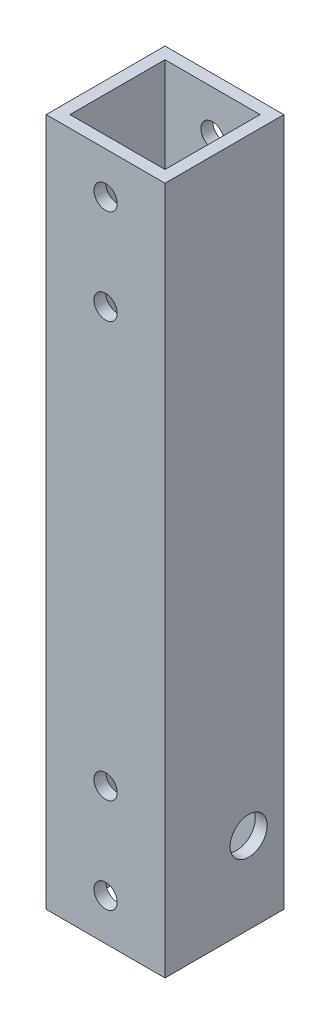
ISO-10303-21;
HEADER;
FILE_DESCRIPTION(('STEP AP214'),'2;1');
FILE_NAME('part.step','',(''),(''),'','','');
FILE_SCHEMA(('AUTOMOTIVE_DESIGN { 1 0 10303 214 1 1 1 1 }'));
ENDSEC;
DATA;
#1=APPLICATION_CONTEXT('core data for automotive mechanical design processes');
#2=APPLICATION_PROTOCOL_DEFINITION('international standard','automotive_design',2000,#1);
#3=PRODUCT_CONTEXT('',#1,'mechanical');
#4=PRODUCT('Part','Part','',(#3));
#5=PRODUCT_RELATED_PRODUCT_CATEGORY('part','',(#4));
#6=PRODUCT_DEFINITION_FORMATION('','',#4);
#7=PRODUCT_DEFINITION_CONTEXT('part definition',#1,'design');
#8=PRODUCT_DEFINITION('design','',#6,#7);
#9=PRODUCT_DEFINITION_SHAPE('','',#8);
#10=(LENGTH_UNIT() NAMED_UNIT(*) SI_UNIT(.MILLI.,.METRE.));
#11=(NAMED_UNIT(*) PLANE_ANGLE_UNIT() SI_UNIT($,.RADIAN.));
#12=(NAMED_UNIT(*) SI_UNIT($,.STERADIAN.) SOLID_ANGLE_UNIT());
#13=UNCERTAINTY_MEASURE_WITH_UNIT(LENGTH_MEASURE(1.E-05),#10,'distance_accuracy_value','');
#14=(GEOMETRIC_REPRESENTATION_CONTEXT(3) GLOBAL_UNCERTAINTY_ASSIGNED_CONTEXT((#13)) GLOBAL_UNIT_ASSIGNED_CONTEXT((#10,
#11,#12)) REPRESENTATION_CONTEXT('',''));
#15=CARTESIAN_POINT('',(0.,0.,0.));
#16=DIRECTION('',(0.,0.,1.));
#17=DIRECTION('',(1.,0.,0.));
#18=AXIS2_PLACEMENT_3D('',#15,#16,#17);
#19=CARTESIAN_POINT('',(25.4,0.,25.4));
#20=DIRECTION('',(0.,1.,0.));
#21=DIRECTION('',(-1.,0.,0.));
#22=AXIS2_PLACEMENT_3D('',#19,#20,#21);
#23=PLANE('',#22);
#24=DIRECTION('',(1.,0.,0.));
#25=VECTOR('',#24,1.);
#26=CARTESIAN_POINT('',(0.,0.,22.86));
#27=LINE('',#26,#25);
#28=CARTESIAN_POINT('',(2.54000000000001,0.,22.86));
#29=VERTEX_POINT('',#28);
#30=CARTESIAN_POINT('',(22.86,0.,22.86));
#31=VERTEX_POINT('',#30);
#32=EDGE_CURVE('E112',#29,#31,#27,.T.);
#33=ORIENTED_EDGE('',*,*,#32,.T.);
#34=DIRECTION('',(0.,0.,-1.));
#35=VECTOR('',#34,1.);
#36=CARTESIAN_POINT('',(22.86,0.,0.));
#37=LINE('',#36,#35);
#38=CARTESIAN_POINT('',(22.86,0.,2.54));
#39=VERTEX_POINT('',#38);
#40=EDGE_CURVE('E106',#31,#39,#37,.T.);
#41=ORIENTED_EDGE('',*,*,#40,.T.);
#42=DIRECTION('',(-1.,0.,0.));
#43=VECTOR('',#42,1.);
#44=CARTESIAN_POINT('',(0.,0.,2.54));
#45=LINE('',#44,#43);
#46=CARTESIAN_POINT('',(2.54,0.,2.54));
#47=VERTEX_POINT('',#46);
#48=EDGE_CURVE('E115',#39,#47,#45,.T.);
#49=ORIENTED_EDGE('',*,*,#48,.T.);
#50=DIRECTION('',(0.,0.,1.));
#51=VECTOR('',#50,1.);
#52=CARTESIAN_POINT('',(2.54,0.,0.));
#53=LINE('',#52,#51);
#54=EDGE_CURVE('E54',#47,#29,#53,.T.);
#55=ORIENTED_EDGE('',*,*,#54,.T.);
#56=EDGE_LOOP('',(#33,#41,#49,#55));
#57=FACE_BOUND('',#56,.T.);
#58=DIRECTION('',(1.,0.,0.));
#59=VECTOR('',#58,1.);
#60=CARTESIAN_POINT('',(25.4,0.,0.));
#61=LINE('',#60,#59);
#62=CARTESIAN_POINT('',(0.,0.,0.));
#63=VERTEX_POINT('',#62);
#64=CARTESIAN_POINT('',(25.4,0.,0.));
#65=VERTEX_POINT('',#64);
#66=EDGE_CURVE('E139',#63,#65,#61,.T.);
#67=ORIENTED_EDGE('',*,*,#66,.T.);
#68=DIRECTION('',(0.,0.,-1.));
#69=VECTOR('',#68,1.);
#70=CARTESIAN_POINT('',(25.4,0.,25.4));
#71=LINE('',#70,#69);
#72=CARTESIAN_POINT('',(25.4,0.,25.4));
#73=VERTEX_POINT('',#72);
#74=EDGE_CURVE('E12',#73,#65,#71,.T.);
#75=ORIENTED_EDGE('',*,*,#74,.F.);
#76=DIRECTION('',(1.,0.,0.));
#77=VECTOR('',#76,1.);
#78=CARTESIAN_POINT('',(25.4,0.,25.4));
#79=LINE('',#78,#77);
#80=CARTESIAN_POINT('',(0.,0.,25.4));
#81=VERTEX_POINT('',#80);
#82=EDGE_CURVE('E143',#81,#73,#79,.T.);
#83=ORIENTED_EDGE('',*,*,#82,.F.);
#84=DIRECTION('',(0.,0.,-1.));
#85=VECTOR('',#84,1.);
#86=CARTESIAN_POINT('',(0.,0.,25.4));
#87=LINE('',#86,#85);
#88=EDGE_CURVE('E153',#81,#63,#87,.T.);
#89=ORIENTED_EDGE('',*,*,#88,.T.);
#90=EDGE_LOOP('',(#67,#75,#83,#89));
#91=FACE_BOUND('',#90,.T.);
#92=ADVANCED_FACE('F38',(#57,#91),#23,.F.);
#93=CARTESIAN_POINT('',(25.4,147.155789,25.4));
#94=DIRECTION('',(-1.,0.,0.));
#95=DIRECTION('',(0.,-1.,0.));
#96=AXIS2_PLACEMENT_3D('',#93,#94,#95);
#97=PLANE('',#96);
#98=CARTESIAN_POINT('',(25.4,17.3804072,7.5184));
#99=DIRECTION('',(1.,0.,0.));
#100=DIRECTION('',(0.,1.,0.));
#101=AXIS2_PLACEMENT_3D('',#98,#99,#100);
#102=CIRCLE('',#101,3.9624);
#103=CARTESIAN_POINT('',(25.4,21.3428072,7.5184));
#104=VERTEX_POINT('',#103);
#105=EDGE_CURVE('E219',#104,#104,#102,.T.);
#106=ORIENTED_EDGE('',*,*,#105,.F.);
#107=EDGE_LOOP('',(#106));
#108=FACE_BOUND('',#107,.T.);
#109=DIRECTION('',(0.,1.,0.));
#110=VECTOR('',#109,1.);
#111=CARTESIAN_POINT('',(25.4,147.155789,0.));
#112=LINE('',#111,#110);
#113=CARTESIAN_POINT('',(25.4,147.155789,0.));
#114=VERTEX_POINT('',#113);
#115=EDGE_CURVE('E156',#65,#114,#112,.T.);
#116=ORIENTED_EDGE('',*,*,#115,.T.);
#117=DIRECTION('',(0.,0.,-1.));
#118=VECTOR('',#117,1.);
#119=CARTESIAN_POINT('',(25.4,147.155789,25.4));
#120=LINE('',#119,#118);
#121=CARTESIAN_POINT('',(25.4,147.155789,25.4));
#122=VERTEX_POINT('',#121);
#123=EDGE_CURVE('E46',#122,#114,#120,.T.);
#124=ORIENTED_EDGE('',*,*,#123,.F.);
#125=DIRECTION('',(0.,1.,0.));
#126=VECTOR('',#125,1.);
#127=CARTESIAN_POINT('',(25.4,147.155789,25.4));
#128=LINE('',#127,#126);
#129=EDGE_CURVE('E146',#73,#122,#128,.T.);
#130=ORIENTED_EDGE('',*,*,#129,.F.);
#131=ORIENTED_EDGE('',*,*,#74,.T.);
#132=EDGE_LOOP('',(#116,#124,#130,#131));
#133=FACE_BOUND('',#132,.T.);
#134=ADVANCED_FACE('F247',(#108,#133),#97,.F.);
#135=CARTESIAN_POINT('',(0.,147.155789,25.4));
#136=DIRECTION('',(0.,-1.,0.));
#137=DIRECTION('',(0.,0.,-1.));
#138=AXIS2_PLACEMENT_3D('',#135,#136,#137);
#139=PLANE('',#138);
#140=DIRECTION('',(-1.,0.,0.));
#141=VECTOR('',#140,1.);
#142=CARTESIAN_POINT('',(0.,147.155789,2.54));
#143=LINE('',#142,#141);
#144=CARTESIAN_POINT('',(22.86,147.155789,2.54));
#145=VERTEX_POINT('',#144);
#146=CARTESIAN_POINT('',(2.54,147.155789,2.54));
#147=VERTEX_POINT('',#146);
#148=EDGE_CURVE('E133',#145,#147,#143,.T.);
#149=ORIENTED_EDGE('',*,*,#148,.F.);
#150=DIRECTION('',(0.,0.,-1.));
#151=VECTOR('',#150,1.);
#152=CARTESIAN_POINT('',(22.86,147.155789,0.));
#153=LINE('',#152,#151);
#154=CARTESIAN_POINT('',(22.86,147.155789,22.86));
#155=VERTEX_POINT('',#154);
#156=EDGE_CURVE('E62',#155,#145,#153,.T.);
#157=ORIENTED_EDGE('',*,*,#156,.F.);
#158=DIRECTION('',(1.,0.,0.));
#159=VECTOR('',#158,1.);
#160=CARTESIAN_POINT('',(0.,147.155789,22.86));
#161=LINE('',#160,#159);
#162=CARTESIAN_POINT('',(2.54000000000001,147.155789,22.86));
#163=VERTEX_POINT('',#162);
#164=EDGE_CURVE('E121',#163,#155,#161,.T.);
#165=ORIENTED_EDGE('',*,*,#164,.F.);
#166=DIRECTION('',(0.,0.,1.));
#167=VECTOR('',#166,1.);
#168=CARTESIAN_POINT('',(2.54,147.155789,0.));
#169=LINE('',#168,#167);
#170=EDGE_CURVE('E124',#147,#163,#169,.T.);
#171=ORIENTED_EDGE('',*,*,#170,.F.);
#172=EDGE_LOOP('',(#149,#157,#165,#171));
#173=FACE_BOUND('',#172,.T.);
#174=DIRECTION('',(-1.,0.,0.));
#175=VECTOR('',#174,1.);
#176=CARTESIAN_POINT('',(0.,147.155789,0.));
#177=LINE('',#176,#175);
#178=CARTESIAN_POINT('',(0.,147.155789,0.));
#179=VERTEX_POINT('',#178);
#180=EDGE_CURVE('E158',#114,#179,#177,.T.);
#181=ORIENTED_EDGE('',*,*,#180,.T.);
#182=DIRECTION('',(0.,0.,-1.));
#183=VECTOR('',#182,1.);
#184=CARTESIAN_POINT('',(0.,147.155789,25.4));
#185=LINE('',#184,#183);
#186=CARTESIAN_POINT('',(0.,147.155789,25.4));
#187=VERTEX_POINT('',#186);
#188=EDGE_CURVE('E163',#187,#179,#185,.T.);
#189=ORIENTED_EDGE('',*,*,#188,.F.);
#190=DIRECTION('',(-1.,0.,0.));
#191=VECTOR('',#190,1.);
#192=CARTESIAN_POINT('',(0.,147.155789,25.4));
#193=LINE('',#192,#191);
#194=EDGE_CURVE('E149',#122,#187,#193,.T.);
#195=ORIENTED_EDGE('',*,*,#194,.F.);
#196=ORIENTED_EDGE('',*,*,#123,.T.);
#197=EDGE_LOOP('',(#181,#189,#195,#196));
#198=FACE_BOUND('',#197,.T.);
#199=ADVANCED_FACE('F251',(#173,#198),#139,.F.);
#200=CARTESIAN_POINT('',(0.,0.,25.4));
#201=DIRECTION('',(1.,0.,0.));
#202=DIRECTION('',(0.,0.,-1.));
#203=AXIS2_PLACEMENT_3D('',#200,#201,#202);
#204=PLANE('',#203);
#205=CARTESIAN_POINT('',(0.,17.3804072,7.5184));
#206=DIRECTION('',(1.,0.,0.));
#207=DIRECTION('',(0.,1.,0.));
#208=AXIS2_PLACEMENT_3D('',#205,#206,#207);
#209=CIRCLE('',#208,3.9624);
#210=CARTESIAN_POINT('',(0.,21.3428072,7.5184));
#211=VERTEX_POINT('',#210);
#212=EDGE_CURVE('E222',#211,#211,#209,.T.);
#213=ORIENTED_EDGE('',*,*,#212,.T.);
#214=EDGE_LOOP('',(#213));
#215=FACE_BOUND('',#214,.T.);
#216=DIRECTION('',(0.,-1.,0.));
#217=VECTOR('',#216,1.);
#218=CARTESIAN_POINT('',(0.,0.,0.));
#219=LINE('',#218,#217);
#220=EDGE_CURVE('E147',#179,#63,#219,.T.);
#221=ORIENTED_EDGE('',*,*,#220,.T.);
#222=ORIENTED_EDGE('',*,*,#88,.F.);
#223=DIRECTION('',(0.,-1.,0.));
#224=VECTOR('',#223,1.);
#225=CARTESIAN_POINT('',(0.,0.,25.4));
#226=LINE('',#225,#224);
#227=EDGE_CURVE('E151',#187,#81,#226,.T.);
#228=ORIENTED_EDGE('',*,*,#227,.F.);
#229=ORIENTED_EDGE('',*,*,#188,.T.);
#230=EDGE_LOOP('',(#221,#222,#228,#229));
#231=FACE_BOUND('',#230,.T.);
#232=ADVANCED_FACE('F256',(#215,#231),#204,.F.);
#233=CARTESIAN_POINT('',(0.,0.,25.4));
#234=DIRECTION('',(0.,0.,-1.));
#235=DIRECTION('',(-1.,0.,0.));
#236=AXIS2_PLACEMENT_3D('',#233,#234,#235);
#237=PLANE('',#236);
#238=CARTESIAN_POINT('',(12.7,138.265789,25.4));
#239=DIRECTION('',(0.,0.,-1.));
#240=DIRECTION('',(-1.,0.,0.));
#241=AXIS2_PLACEMENT_3D('',#238,#239,#240);
#242=CIRCLE('',#241,2.48919999999997);
#243=CARTESIAN_POINT('',(10.2108000000001,138.265789,25.4));
#244=VERTEX_POINT('',#243);
#245=EDGE_CURVE('E172',#244,#244,#242,.T.);
#246=ORIENTED_EDGE('',*,*,#245,.T.);
#247=EDGE_LOOP('',(#246));
#248=FACE_BOUND('',#247,.T.);
#249=CARTESIAN_POINT('',(12.7,117.945789,25.4));
#250=DIRECTION('',(0.,0.,-1.));
#251=DIRECTION('',(-1.,0.,0.));
#252=AXIS2_PLACEMENT_3D('',#249,#250,#251);
#253=CIRCLE('',#252,2.48920000000001);
#254=CARTESIAN_POINT('',(10.2108,117.945789,25.4));
#255=VERTEX_POINT('',#254);
#256=EDGE_CURVE('E209',#255,#255,#253,.T.);
#257=ORIENTED_EDGE('',*,*,#256,.T.);
#258=EDGE_LOOP('',(#257));
#259=FACE_BOUND('',#258,.T.);
#260=CARTESIAN_POINT('',(12.7,29.21,25.4));
#261=DIRECTION('',(0.,0.,-1.));
#262=DIRECTION('',(-1.,0.,0.));
#263=AXIS2_PLACEMENT_3D('',#260,#261,#262);
#264=CIRCLE('',#263,2.4892);
#265=CARTESIAN_POINT('',(10.2108,29.21,25.4));
#266=VERTEX_POINT('',#265);
#267=EDGE_CURVE('E203',#266,#266,#264,.T.);
#268=ORIENTED_EDGE('',*,*,#267,.T.);
#269=EDGE_LOOP('',(#268));
#270=FACE_BOUND('',#269,.T.);
#271=CARTESIAN_POINT('',(12.7,8.89,25.4));
#272=DIRECTION('',(0.,0.,-1.));
#273=DIRECTION('',(-1.,0.,0.));
#274=AXIS2_PLACEMENT_3D('',#271,#272,#273);
#275=CIRCLE('',#274,2.4892);
#276=CARTESIAN_POINT('',(10.2108,8.89,25.4));
#277=VERTEX_POINT('',#276);
#278=EDGE_CURVE('E196',#277,#277,#275,.T.);
#279=ORIENTED_EDGE('',*,*,#278,.T.);
#280=EDGE_LOOP('',(#279));
#281=FACE_BOUND('',#280,.T.);
#282=ORIENTED_EDGE('',*,*,#82,.T.);
#283=ORIENTED_EDGE('',*,*,#129,.T.);
#284=ORIENTED_EDGE('',*,*,#194,.T.);
#285=ORIENTED_EDGE('',*,*,#227,.T.);
#286=EDGE_LOOP('',(#282,#283,#284,#285));
#287=FACE_BOUND('',#286,.T.);
#288=ADVANCED_FACE('F264',(#248,#259,#270,#281,#287),#237,.F.);
#289=CARTESIAN_POINT('',(0.,0.,0.));
#290=DIRECTION('',(0.,0.,-1.));
#291=DIRECTION('',(-1.,0.,0.));
#292=AXIS2_PLACEMENT_3D('',#289,#290,#291);
#293=PLANE('',#292);
#294=CARTESIAN_POINT('',(12.7,138.265789,0.));
#295=DIRECTION('',(0.,0.,-1.));
#296=DIRECTION('',(-1.,0.,0.));
#297=AXIS2_PLACEMENT_3D('',#294,#295,#296);
#298=CIRCLE('',#297,2.48919999999997);
#299=CARTESIAN_POINT('',(10.2108000000001,138.265789,0.));
#300=VERTEX_POINT('',#299);
#301=EDGE_CURVE('E212',#300,#300,#298,.T.);
#302=ORIENTED_EDGE('',*,*,#301,.F.);
#303=EDGE_LOOP('',(#302));
#304=FACE_BOUND('',#303,.T.);
#305=CARTESIAN_POINT('',(12.7,117.945789,0.));
#306=DIRECTION('',(0.,0.,-1.));
#307=DIRECTION('',(-1.,0.,0.));
#308=AXIS2_PLACEMENT_3D('',#305,#306,#307);
#309=CIRCLE('',#308,2.48920000000001);
#310=CARTESIAN_POINT('',(10.2108,117.945789,0.));
#311=VERTEX_POINT('',#310);
#312=EDGE_CURVE('E206',#311,#311,#309,.T.);
#313=ORIENTED_EDGE('',*,*,#312,.F.);
#314=EDGE_LOOP('',(#313));
#315=FACE_BOUND('',#314,.T.);
#316=CARTESIAN_POINT('',(12.7,29.21,0.));
#317=DIRECTION('',(0.,0.,-1.));
#318=DIRECTION('',(-1.,0.,0.));
#319=AXIS2_PLACEMENT_3D('',#316,#317,#318);
#320=CIRCLE('',#319,2.4892);
#321=CARTESIAN_POINT('',(10.2108,29.21,0.));
#322=VERTEX_POINT('',#321);
#323=EDGE_CURVE('E200',#322,#322,#320,.T.);
#324=ORIENTED_EDGE('',*,*,#323,.F.);
#325=EDGE_LOOP('',(#324));
#326=FACE_BOUND('',#325,.T.);
#327=CARTESIAN_POINT('',(12.7,8.89,0.));
#328=DIRECTION('',(0.,0.,-1.));
#329=DIRECTION('',(-1.,0.,0.));
#330=AXIS2_PLACEMENT_3D('',#327,#328,#329);
#331=CIRCLE('',#330,2.4892);
#332=CARTESIAN_POINT('',(10.2108,8.89,0.));
#333=VERTEX_POINT('',#332);
#334=EDGE_CURVE('E193',#333,#333,#331,.T.);
#335=ORIENTED_EDGE('',*,*,#334,.F.);
#336=EDGE_LOOP('',(#335));
#337=FACE_BOUND('',#336,.T.);
#338=ORIENTED_EDGE('',*,*,#66,.F.);
#339=ORIENTED_EDGE('',*,*,#220,.F.);
#340=ORIENTED_EDGE('',*,*,#180,.F.);
#341=ORIENTED_EDGE('',*,*,#115,.F.);
#342=EDGE_LOOP('',(#338,#339,#340,#341));
#343=FACE_BOUND('',#342,.T.);
#344=ADVANCED_FACE('F265',(#304,#315,#326,#337,#343),#293,.T.);
#345=CARTESIAN_POINT('',(22.86,0.,0.));
#346=DIRECTION('',(1.,0.,0.));
#347=DIRECTION('',(0.,0.,-1.));
#348=AXIS2_PLACEMENT_3D('',#345,#346,#347);
#349=PLANE('',#348);
#350=CARTESIAN_POINT('',(22.86,17.3804072,7.5184));
#351=DIRECTION('',(1.,0.,0.));
#352=DIRECTION('',(0.,0.,-1.));
#353=AXIS2_PLACEMENT_3D('',#350,#351,#352);
#354=CIRCLE('',#353,3.9624);
#355=CARTESIAN_POINT('',(22.86,17.3804072,3.556));
#356=VERTEX_POINT('',#355);
#357=EDGE_CURVE('E197',#356,#356,#354,.T.);
#358=ORIENTED_EDGE('',*,*,#357,.T.);
#359=EDGE_LOOP('',(#358));
#360=FACE_BOUND('',#359,.T.);
#361=ORIENTED_EDGE('',*,*,#156,.T.);
#362=DIRECTION('',(0.,1.,0.));
#363=VECTOR('',#362,1.);
#364=CARTESIAN_POINT('',(22.86,0.,2.54));
#365=LINE('',#364,#363);
#366=EDGE_CURVE('E102',#39,#145,#365,.T.);
#367=ORIENTED_EDGE('',*,*,#366,.F.);
#368=ORIENTED_EDGE('',*,*,#40,.F.);
#369=DIRECTION('',(0.,1.,0.));
#370=VECTOR('',#369,1.);
#371=CARTESIAN_POINT('',(22.86,0.,22.86));
#372=LINE('',#371,#370);
#373=EDGE_CURVE('E137',#31,#155,#372,.T.);
#374=ORIENTED_EDGE('',*,*,#373,.T.);
#375=EDGE_LOOP('',(#361,#367,#368,#374));
#376=FACE_BOUND('',#375,.T.);
#377=ADVANCED_FACE('F104',(#360,#376),#349,.F.);
#378=CARTESIAN_POINT('',(0.,0.,22.86));
#379=DIRECTION('',(0.,0.,1.));
#380=DIRECTION('',(1.,0.,0.));
#381=AXIS2_PLACEMENT_3D('',#378,#379,#380);
#382=PLANE('',#381);
#383=CARTESIAN_POINT('',(12.7,138.265789,22.86));
#384=DIRECTION('',(0.,0.,1.));
#385=DIRECTION('',(1.,0.,0.));
#386=AXIS2_PLACEMENT_3D('',#383,#384,#385);
#387=CIRCLE('',#386,2.48919999999997);
#388=CARTESIAN_POINT('',(15.1892,138.265789,22.86));
#389=VERTEX_POINT('',#388);
#390=EDGE_CURVE('E127',#389,#389,#387,.T.);
#391=ORIENTED_EDGE('',*,*,#390,.T.);
#392=EDGE_LOOP('',(#391));
#393=FACE_BOUND('',#392,.T.);
#394=CARTESIAN_POINT('',(12.7,117.945789,22.86));
#395=DIRECTION('',(0.,0.,1.));
#396=DIRECTION('',(1.,0.,0.));
#397=AXIS2_PLACEMENT_3D('',#394,#395,#396);
#398=CIRCLE('',#397,2.48920000000001);
#399=CARTESIAN_POINT('',(15.1892,117.945789,22.86));
#400=VERTEX_POINT('',#399);
#401=EDGE_CURVE('E179',#400,#400,#398,.T.);
#402=ORIENTED_EDGE('',*,*,#401,.T.);
#403=EDGE_LOOP('',(#402));
#404=FACE_BOUND('',#403,.T.);
#405=CARTESIAN_POINT('',(12.7,29.21,22.86));
#406=DIRECTION('',(0.,0.,1.));
#407=DIRECTION('',(1.,0.,0.));
#408=AXIS2_PLACEMENT_3D('',#405,#406,#407);
#409=CIRCLE('',#408,2.4892);
#410=CARTESIAN_POINT('',(15.1892,29.21,22.86));
#411=VERTEX_POINT('',#410);
#412=EDGE_CURVE('E176',#411,#411,#409,.T.);
#413=ORIENTED_EDGE('',*,*,#412,.T.);
#414=EDGE_LOOP('',(#413));
#415=FACE_BOUND('',#414,.T.);
#416=CARTESIAN_POINT('',(12.7,8.89,22.86));
#417=DIRECTION('',(0.,0.,1.));
#418=DIRECTION('',(1.,0.,0.));
#419=AXIS2_PLACEMENT_3D('',#416,#417,#418);
#420=CIRCLE('',#419,2.4892);
#421=CARTESIAN_POINT('',(15.1892,8.89,22.86));
#422=VERTEX_POINT('',#421);
#423=EDGE_CURVE('E171',#422,#422,#420,.T.);
#424=ORIENTED_EDGE('',*,*,#423,.T.);
#425=EDGE_LOOP('',(#424));
#426=FACE_BOUND('',#425,.T.);
#427=ORIENTED_EDGE('',*,*,#164,.T.);
#428=ORIENTED_EDGE('',*,*,#373,.F.);
#429=ORIENTED_EDGE('',*,*,#32,.F.);
#430=DIRECTION('',(0.,1.,0.));
#431=VECTOR('',#430,1.);
#432=CARTESIAN_POINT('',(2.54000000000001,0.,22.86));
#433=LINE('',#432,#431);
#434=EDGE_CURVE('E140',#29,#163,#433,.T.);
#435=ORIENTED_EDGE('',*,*,#434,.T.);
#436=EDGE_LOOP('',(#427,#428,#429,#435));
#437=FACE_BOUND('',#436,.T.);
#438=ADVANCED_FACE('F274',(#393,#404,#415,#426,#437),#382,.F.);
#439=CARTESIAN_POINT('',(2.54,0.,0.));
#440=DIRECTION('',(-1.,0.,0.));
#441=DIRECTION('',(0.,0.,1.));
#442=AXIS2_PLACEMENT_3D('',#439,#440,#441);
#443=PLANE('',#442);
#444=CARTESIAN_POINT('',(2.54,17.3804072,7.5184));
#445=DIRECTION('',(-1.,0.,0.));
#446=DIRECTION('',(0.,0.,1.));
#447=AXIS2_PLACEMENT_3D('',#444,#445,#446);
#448=CIRCLE('',#447,3.9624);
#449=CARTESIAN_POINT('',(2.54,17.3804072,11.4808));
#450=VERTEX_POINT('',#449);
#451=EDGE_CURVE('E41',#450,#450,#448,.T.);
#452=ORIENTED_EDGE('',*,*,#451,.T.);
#453=EDGE_LOOP('',(#452));
#454=FACE_BOUND('',#453,.T.);
#455=ORIENTED_EDGE('',*,*,#170,.T.);
#456=ORIENTED_EDGE('',*,*,#434,.F.);
#457=ORIENTED_EDGE('',*,*,#54,.F.);
#458=DIRECTION('',(0.,1.,0.));
#459=VECTOR('',#458,1.);
#460=CARTESIAN_POINT('',(2.54,0.,2.54));
#461=LINE('',#460,#459);
#462=EDGE_CURVE('E111',#47,#147,#461,.T.);
#463=ORIENTED_EDGE('',*,*,#462,.T.);
#464=EDGE_LOOP('',(#455,#456,#457,#463));
#465=FACE_BOUND('',#464,.T.);
#466=ADVANCED_FACE('F229',(#454,#465),#443,.F.);
#467=CARTESIAN_POINT('',(0.,0.,2.54));
#468=DIRECTION('',(0.,0.,-1.));
#469=DIRECTION('',(-1.,0.,0.));
#470=AXIS2_PLACEMENT_3D('',#467,#468,#469);
#471=PLANE('',#470);
#472=CARTESIAN_POINT('',(12.7,138.265789,2.54));
#473=DIRECTION('',(0.,0.,-1.));
#474=DIRECTION('',(-1.,0.,0.));
#475=AXIS2_PLACEMENT_3D('',#472,#473,#474);
#476=CIRCLE('',#475,2.48919999999997);
#477=CARTESIAN_POINT('',(10.2108000000001,138.265789,2.54));
#478=VERTEX_POINT('',#477);
#479=EDGE_CURVE('E180',#478,#478,#476,.T.);
#480=ORIENTED_EDGE('',*,*,#479,.T.);
#481=EDGE_LOOP('',(#480));
#482=FACE_BOUND('',#481,.T.);
#483=CARTESIAN_POINT('',(12.7,117.945789,2.54));
#484=DIRECTION('',(0.,0.,-1.));
#485=DIRECTION('',(-1.,0.,0.));
#486=AXIS2_PLACEMENT_3D('',#483,#484,#485);
#487=CIRCLE('',#486,2.48920000000001);
#488=CARTESIAN_POINT('',(10.2108,117.945789,2.54));
#489=VERTEX_POINT('',#488);
#490=EDGE_CURVE('E177',#489,#489,#487,.T.);
#491=ORIENTED_EDGE('',*,*,#490,.T.);
#492=EDGE_LOOP('',(#491));
#493=FACE_BOUND('',#492,.T.);
#494=CARTESIAN_POINT('',(12.7,29.21,2.54));
#495=DIRECTION('',(0.,0.,-1.));
#496=DIRECTION('',(-1.,0.,0.));
#497=AXIS2_PLACEMENT_3D('',#494,#495,#496);
#498=CIRCLE('',#497,2.4892);
#499=CARTESIAN_POINT('',(10.2108,29.21,2.54));
#500=VERTEX_POINT('',#499);
#501=EDGE_CURVE('E173',#500,#500,#498,.T.);
#502=ORIENTED_EDGE('',*,*,#501,.T.);
#503=EDGE_LOOP('',(#502));
#504=FACE_BOUND('',#503,.T.);
#505=CARTESIAN_POINT('',(12.7,8.89,2.54));
#506=DIRECTION('',(0.,0.,-1.));
#507=DIRECTION('',(-1.,0.,0.));
#508=AXIS2_PLACEMENT_3D('',#505,#506,#507);
#509=CIRCLE('',#508,2.4892);
#510=CARTESIAN_POINT('',(10.2108,8.89,2.54));
#511=VERTEX_POINT('',#510);
#512=EDGE_CURVE('E168',#511,#511,#509,.T.);
#513=ORIENTED_EDGE('',*,*,#512,.T.);
#514=EDGE_LOOP('',(#513));
#515=FACE_BOUND('',#514,.T.);
#516=ORIENTED_EDGE('',*,*,#148,.T.);
#517=ORIENTED_EDGE('',*,*,#462,.F.);
#518=ORIENTED_EDGE('',*,*,#48,.F.);
#519=ORIENTED_EDGE('',*,*,#366,.T.);
#520=EDGE_LOOP('',(#516,#517,#518,#519));
#521=FACE_BOUND('',#520,.T.);
#522=ADVANCED_FACE('F116',(#482,#493,#504,#515,#521),#471,.F.);
#523=CARTESIAN_POINT('',(12.7,8.89,25.4));
#524=DIRECTION('',(0.,0.,-1.));
#525=DIRECTION('',(-1.,0.,0.));
#526=AXIS2_PLACEMENT_3D('',#523,#524,#525);
#527=CYLINDRICAL_SURFACE('',#526,2.4892);
#528=ORIENTED_EDGE('',*,*,#334,.T.);
#529=EDGE_LOOP('',(#528));
#530=FACE_BOUND('',#529,.T.);
#531=ORIENTED_EDGE('',*,*,#512,.F.);
#532=EDGE_LOOP('',(#531));
#533=FACE_BOUND('',#532,.T.);
#534=ADVANCED_FACE('F278',(#530,#533),#527,.F.);
#535=CARTESIAN_POINT('',(12.7,29.21,25.4));
#536=DIRECTION('',(0.,0.,-1.));
#537=DIRECTION('',(-1.,0.,0.));
#538=AXIS2_PLACEMENT_3D('',#535,#536,#537);
#539=CYLINDRICAL_SURFACE('',#538,2.4892);
#540=ORIENTED_EDGE('',*,*,#323,.T.);
#541=EDGE_LOOP('',(#540));
#542=FACE_BOUND('',#541,.T.);
#543=ORIENTED_EDGE('',*,*,#501,.F.);
#544=EDGE_LOOP('',(#543));
#545=FACE_BOUND('',#544,.T.);
#546=ADVANCED_FACE('F292',(#542,#545),#539,.F.);
#547=CARTESIAN_POINT('',(12.7,117.945789,25.4));
#548=DIRECTION('',(0.,0.,-1.));
#549=DIRECTION('',(-1.,0.,0.));
#550=AXIS2_PLACEMENT_3D('',#547,#548,#549);
#551=CYLINDRICAL_SURFACE('',#550,2.48920000000001);
#552=ORIENTED_EDGE('',*,*,#312,.T.);
#553=EDGE_LOOP('',(#552));
#554=FACE_BOUND('',#553,.T.);
#555=ORIENTED_EDGE('',*,*,#490,.F.);
#556=EDGE_LOOP('',(#555));
#557=FACE_BOUND('',#556,.T.);
#558=ADVANCED_FACE('F295',(#554,#557),#551,.F.);
#559=CARTESIAN_POINT('',(12.7,138.265789,25.4));
#560=DIRECTION('',(0.,0.,-1.));
#561=DIRECTION('',(-1.,0.,0.));
#562=AXIS2_PLACEMENT_3D('',#559,#560,#561);
#563=CYLINDRICAL_SURFACE('',#562,2.48919999999997);
#564=ORIENTED_EDGE('',*,*,#301,.T.);
#565=EDGE_LOOP('',(#564));
#566=FACE_BOUND('',#565,.T.);
#567=ORIENTED_EDGE('',*,*,#479,.F.);
#568=EDGE_LOOP('',(#567));
#569=FACE_BOUND('',#568,.T.);
#570=ADVANCED_FACE('F245',(#566,#569),#563,.F.);
#571=ORIENTED_EDGE('',*,*,#278,.F.);
#572=EDGE_LOOP('',(#571));
#573=FACE_BOUND('',#572,.T.);
#574=ORIENTED_EDGE('',*,*,#423,.F.);
#575=EDGE_LOOP('',(#574));
#576=FACE_BOUND('',#575,.T.);
#577=ADVANCED_FACE('F284',(#573,#576),#527,.F.);
#578=ORIENTED_EDGE('',*,*,#267,.F.);
#579=EDGE_LOOP('',(#578));
#580=FACE_BOUND('',#579,.T.);
#581=ORIENTED_EDGE('',*,*,#412,.F.);
#582=EDGE_LOOP('',(#581));
#583=FACE_BOUND('',#582,.T.);
#584=ADVANCED_FACE('F287',(#580,#583),#539,.F.);
#585=ORIENTED_EDGE('',*,*,#256,.F.);
#586=EDGE_LOOP('',(#585));
#587=FACE_BOUND('',#586,.T.);
#588=ORIENTED_EDGE('',*,*,#401,.F.);
#589=EDGE_LOOP('',(#588));
#590=FACE_BOUND('',#589,.T.);
#591=ADVANCED_FACE('F242',(#587,#590),#551,.F.);
#592=ORIENTED_EDGE('',*,*,#245,.F.);
#593=EDGE_LOOP('',(#592));
#594=FACE_BOUND('',#593,.T.);
#595=ORIENTED_EDGE('',*,*,#390,.F.);
#596=EDGE_LOOP('',(#595));
#597=FACE_BOUND('',#596,.T.);
#598=ADVANCED_FACE('F234',(#594,#597),#563,.F.);
#599=CARTESIAN_POINT('',(0.,17.3804072,7.5184));
#600=DIRECTION('',(1.,0.,0.));
#601=DIRECTION('',(0.,1.,0.));
#602=AXIS2_PLACEMENT_3D('',#599,#600,#601);
#603=CYLINDRICAL_SURFACE('',#602,3.9624);
#604=ORIENTED_EDGE('',*,*,#212,.F.);
#605=EDGE_LOOP('',(#604));
#606=FACE_BOUND('',#605,.T.);
#607=ORIENTED_EDGE('',*,*,#451,.F.);
#608=EDGE_LOOP('',(#607));
#609=FACE_BOUND('',#608,.T.);
#610=ADVANCED_FACE('F231',(#606,#609),#603,.F.);
#611=ORIENTED_EDGE('',*,*,#105,.T.);
#612=EDGE_LOOP('',(#611));
#613=FACE_BOUND('',#612,.T.);
#614=ORIENTED_EDGE('',*,*,#357,.F.);
#615=EDGE_LOOP('',(#614));
#616=FACE_BOUND('',#615,.T.);
#617=ADVANCED_FACE('F233',(#613,#616),#603,.F.);
#618=CLOSED_SHELL('',(#92,#134,#199,#232,#288,#344,#377,#438,#466,#522,#534,#546,#558,#570,#577,
#584,#591,#598,#610,#617));
#619=MANIFOLD_SOLID_BREP('B2',#618);
#620=ADVANCED_BREP_SHAPE_REPRESENTATION('',(#18,#619),#14);
#621=SHAPE_DEFINITION_REPRESENTATION(#9,#620);
ENDSEC;
END-ISO-10303-21;
